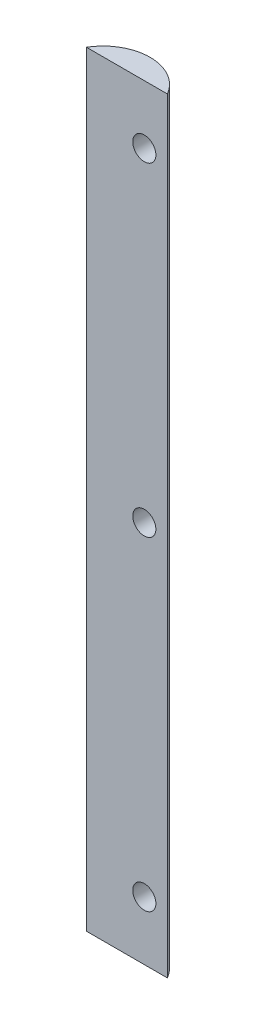
ISO-10303-21;
HEADER;
FILE_DESCRIPTION(('STEP AP214'),'2;1');
FILE_NAME('part.step','',(''),(''),'','','');
FILE_SCHEMA(('AUTOMOTIVE_DESIGN { 1 0 10303 214 1 1 1 1 }'));
ENDSEC;
DATA;
#1=APPLICATION_CONTEXT('core data for automotive mechanical design processes');
#2=APPLICATION_PROTOCOL_DEFINITION('international standard','automotive_design',2000,#1);
#3=PRODUCT_CONTEXT('',#1,'mechanical');
#4=PRODUCT('Part','Part','',(#3));
#5=PRODUCT_RELATED_PRODUCT_CATEGORY('part','',(#4));
#6=PRODUCT_DEFINITION_FORMATION('','',#4);
#7=PRODUCT_DEFINITION_CONTEXT('part definition',#1,'design');
#8=PRODUCT_DEFINITION('design','',#6,#7);
#9=PRODUCT_DEFINITION_SHAPE('','',#8);
#10=(LENGTH_UNIT() NAMED_UNIT(*) SI_UNIT(.MILLI.,.METRE.));
#11=(NAMED_UNIT(*) PLANE_ANGLE_UNIT() SI_UNIT($,.RADIAN.));
#12=(NAMED_UNIT(*) SI_UNIT($,.STERADIAN.) SOLID_ANGLE_UNIT());
#13=UNCERTAINTY_MEASURE_WITH_UNIT(LENGTH_MEASURE(1.E-05),#10,'distance_accuracy_value','');
#14=(GEOMETRIC_REPRESENTATION_CONTEXT(3) GLOBAL_UNCERTAINTY_ASSIGNED_CONTEXT((#13)) GLOBAL_UNIT_ASSIGNED_CONTEXT((#10,
#11,#12)) REPRESENTATION_CONTEXT('',''));
#15=CARTESIAN_POINT('',(0.,0.,0.));
#16=DIRECTION('',(0.,0.,1.));
#17=DIRECTION('',(1.,0.,0.));
#18=AXIS2_PLACEMENT_3D('',#15,#16,#17);
#19=CARTESIAN_POINT('',(0.,203.622402,0.));
#20=DIRECTION('',(0.,0.,-1.));
#21=DIRECTION('',(-1.,0.,0.));
#22=AXIS2_PLACEMENT_3D('',#19,#20,#21);
#23=PLANE('',#22);
#24=CARTESIAN_POINT('',(0.,9.736074,0.));
#25=DIRECTION('',(0.,0.,1.));
#26=DIRECTION('',(1.,0.,0.));
#27=AXIS2_PLACEMENT_3D('',#24,#25,#26);
#28=CIRCLE('',#27,3.175);
#29=CARTESIAN_POINT('',(3.175,9.736074,0.));
#30=VERTEX_POINT('',#29);
#31=EDGE_CURVE('E101',#30,#30,#28,.T.);
#32=ORIENTED_EDGE('',*,*,#31,.F.);
#33=EDGE_LOOP('',(#32));
#34=FACE_BOUND('',#33,.T.);
#35=CARTESIAN_POINT('',(0.,187.536328,0.));
#36=DIRECTION('',(0.,0.,1.));
#37=DIRECTION('',(1.,0.,0.));
#38=AXIS2_PLACEMENT_3D('',#35,#36,#37);
#39=CIRCLE('',#38,3.175);
#40=CARTESIAN_POINT('',(3.175,187.536328,0.));
#41=VERTEX_POINT('',#40);
#42=EDGE_CURVE('E132',#41,#41,#39,.T.);
#43=ORIENTED_EDGE('',*,*,#42,.F.);
#44=EDGE_LOOP('',(#43));
#45=FACE_BOUND('',#44,.T.);
#46=CARTESIAN_POINT('',(0.,98.636201,0.));
#47=DIRECTION('',(0.,0.,1.));
#48=DIRECTION('',(1.,0.,0.));
#49=AXIS2_PLACEMENT_3D('',#46,#47,#48);
#50=CIRCLE('',#49,3.175);
#51=CARTESIAN_POINT('',(3.175,98.636201,0.));
#52=VERTEX_POINT('',#51);
#53=EDGE_CURVE('E135',#52,#52,#50,.T.);
#54=ORIENTED_EDGE('',*,*,#53,.F.);
#55=EDGE_LOOP('',(#54));
#56=FACE_BOUND('',#55,.T.);
#57=DIRECTION('',(1.,0.,0.));
#58=VECTOR('',#57,1.);
#59=CARTESIAN_POINT('',(0.,-6.35,0.));
#60=LINE('',#59,#58);
#61=CARTESIAN_POINT('',(-15.875,-6.35,0.));
#62=VERTEX_POINT('',#61);
#63=CARTESIAN_POINT('',(6.35,-6.35,0.));
#64=VERTEX_POINT('',#63);
#65=EDGE_CURVE('E74',#62,#64,#60,.T.);
#66=ORIENTED_EDGE('',*,*,#65,.T.);
#67=DIRECTION('',(0.,-1.,0.));
#68=VECTOR('',#67,1.);
#69=CARTESIAN_POINT('',(6.35,203.622402,0.));
#70=LINE('',#69,#68);
#71=CARTESIAN_POINT('',(6.35,203.622402,0.));
#72=VERTEX_POINT('',#71);
#73=EDGE_CURVE('E11',#72,#64,#70,.T.);
#74=ORIENTED_EDGE('',*,*,#73,.F.);
#75=DIRECTION('',(1.,0.,0.));
#76=VECTOR('',#75,1.);
#77=CARTESIAN_POINT('',(0.,203.622402,0.));
#78=LINE('',#77,#76);
#79=CARTESIAN_POINT('',(-15.875,203.622402,0.));
#80=VERTEX_POINT('',#79);
#81=EDGE_CURVE('E86',#80,#72,#78,.T.);
#82=ORIENTED_EDGE('',*,*,#81,.F.);
#83=DIRECTION('',(0.,-1.,0.));
#84=VECTOR('',#83,1.);
#85=CARTESIAN_POINT('',(-15.875,203.622402,0.));
#86=LINE('',#85,#84);
#87=EDGE_CURVE('E57',#80,#62,#86,.T.);
#88=ORIENTED_EDGE('',*,*,#87,.T.);
#89=EDGE_LOOP('',(#66,#74,#82,#88));
#90=FACE_BOUND('',#89,.T.);
#91=ADVANCED_FACE('F43',(#34,#45,#56,#90),#23,.F.);
#92=CARTESIAN_POINT('',(-4.7625,203.622402,6.5484375));
#93=DIRECTION('',(0.,-1.,0.));
#94=DIRECTION('',(0.,0.,-1.));
#95=AXIS2_PLACEMENT_3D('',#92,#93,#94);
#96=CYLINDRICAL_SURFACE('',#95,12.8984375);
#97=CARTESIAN_POINT('',(3.175,9.736074,-3.61845896310054));
#98=CARTESIAN_POINT('',(3.17500029155845,9.8133440701708,-3.61845865162707));
#99=CARTESIAN_POINT('',(3.17217494628216,9.89061074148565,-3.62066641748478));
#100=CARTESIAN_POINT('',(3.16092477458739,10.0445145006741,-3.62943459894672));
#101=CARTESIAN_POINT('',(3.15249779231336,10.1211513346468,-3.63599669036239));
#102=CARTESIAN_POINT('',(3.13018830916982,10.2731438067568,-3.65329567583612));
#103=CARTESIAN_POINT('',(3.11630605119873,10.3484995017814,-3.6640323840174));
#104=CARTESIAN_POINT('',(3.08331514599964,10.4974013946925,-3.68939941002583));
#105=CARTESIAN_POINT('',(3.06420415714726,10.5709467657243,-3.7040314722612));
#106=CARTESIAN_POINT('',(2.99970218374855,10.7872154174017,-3.75305885545856));
#107=CARTESIAN_POINT('',(2.9469791643884,10.9266448482926,-3.79271518717727));
#108=CARTESIAN_POINT('',(2.82442881282292,11.1937761756134,-3.88295570262731));
#109=CARTESIAN_POINT('',(2.7545956444484,11.3214740500019,-3.93354361435851));
#110=CARTESIAN_POINT('',(2.59237992999635,11.5759558374709,-4.04808197326832));
#111=CARTESIAN_POINT('',(2.49844020076017,11.7013695954862,-4.11286301294358));
#112=CARTESIAN_POINT('',(2.29521823437965,11.9353118533229,-4.24847208060614));
#113=CARTESIAN_POINT('',(2.1859279353107,12.043831416977,-4.31930327835022));
#114=CARTESIAN_POINT('',(1.93138065942859,12.2626888557397,-4.47826997752821));
#115=CARTESIAN_POINT('',(1.78326915895043,12.3692354108075,-4.56708150040061));
#116=CARTESIAN_POINT('',(1.47119073823517,12.5555258022771,-4.74506321575416));
#117=CARTESIAN_POINT('',(1.30721296467085,12.6352511223092,-4.83423361318672));
#118=CARTESIAN_POINT('',(0.951295750286284,12.7716994809198,-5.01726678919523));
#119=CARTESIAN_POINT('',(0.75816587202052,12.8257675573429,-5.11084798187377));
#120=CARTESIAN_POINT('',(0.461109140868175,12.8790287940601,-5.24544016431096));
#121=CARTESIAN_POINT('',(0.360810762795936,12.8921419716694,-5.28936166307804));
#122=CARTESIAN_POINT('',(0.158465095092233,12.9087383343744,-5.37489298816599));
#123=CARTESIAN_POINT('',(0.0564187624306976,12.9122266293902,-5.41650402962234));
#124=CARTESIAN_POINT('',(-0.143697886170487,12.909323369538,-5.49512385220796));
#125=CARTESIAN_POINT('',(-0.24172620120115,12.9033942697464,-5.53225742551915));
#126=CARTESIAN_POINT('',(-0.437737274208506,12.8822970611551,-5.60380473376646));
#127=CARTESIAN_POINT('',(-0.535720030560132,12.8671335550416,-5.63821981402773));
#128=CARTESIAN_POINT('',(-0.730737999312872,12.8274403451485,-5.70412048241188));
#129=CARTESIAN_POINT('',(-0.827773509636956,12.8029136903861,-5.73560702003919));
#130=CARTESIAN_POINT('',(-1.0199433424238,12.7444661928637,-5.79551187375221));
#131=CARTESIAN_POINT('',(-1.11507785488985,12.7105462940378,-5.82393049773622));
#132=CARTESIAN_POINT('',(-1.2932752926261,12.6371810333219,-5.8750043601246));
#133=CARTESIAN_POINT('',(-1.3766104012884,12.5985976486948,-5.89795138845065));
#134=CARTESIAN_POINT('',(-1.54016736468118,12.5140208516425,-5.94129517591087));
#135=CARTESIAN_POINT('',(-1.62038811983224,12.4680248510579,-5.96169103985667));
#136=CARTESIAN_POINT('',(-1.77687845129753,12.3689232250418,-5.99995831517187));
#137=CARTESIAN_POINT('',(-1.85315059963565,12.3158223104882,-6.01783138326943));
#138=CARTESIAN_POINT('',(-2.00107961503945,12.2028501830638,-6.05116594048672));
#139=CARTESIAN_POINT('',(-2.07273482176762,12.142976555695,-6.06662656485746));
#140=CARTESIAN_POINT('',(-2.27159400513747,11.9612359662489,-6.10788997306092));
#141=CARTESIAN_POINT('',(-2.39212476680084,11.8312218078877,-6.13080529239027));
#142=CARTESIAN_POINT('',(-2.61018571307227,11.5523696410865,-6.169643174857));
#143=CARTESIAN_POINT('',(-2.70771789937332,11.4035332725808,-6.18556634666366));
#144=CARTESIAN_POINT('',(-2.87574692225581,11.0930857816891,-6.21153952657473));
#145=CARTESIAN_POINT('',(-2.94654490001103,10.9316433031202,-6.22165566629257));
#146=CARTESIAN_POINT('',(-3.0605142619,10.5990819302186,-6.23734638899209));
#147=CARTESIAN_POINT('',(-3.10368515705651,10.4279628646765,-6.24292089159091));
#148=CARTESIAN_POINT('',(-3.16124439987613,10.0801186249881,-6.25025492095319));
#149=CARTESIAN_POINT('',(-3.17550914635837,9.90337264518706,-6.25199806771476));
#150=CARTESIAN_POINT('',(-3.17446299904402,9.54996704055326,-6.25186828729976));
#151=CARTESIAN_POINT('',(-3.15915145950071,9.37330741769018,-6.24999528117078));
#152=CARTESIAN_POINT('',(-3.09932960260839,9.02463623712956,-6.24235818988753));
#153=CARTESIAN_POINT('',(-3.05474731888307,8.85263722633677,-6.2365845133512));
#154=CARTESIAN_POINT('',(-2.93765612238383,8.51865356832839,-6.22039579970276));
#155=CARTESIAN_POINT('',(-2.86514769772941,8.35666874613276,-6.20998084371483));
#156=CARTESIAN_POINT('',(-2.69464055060396,8.04770240415692,-6.18345321124056));
#157=CARTESIAN_POINT('',(-2.5966988674882,7.90068832360842,-6.16735325583885));
#158=CARTESIAN_POINT('',(-2.37838771763343,7.62544732575389,-6.12823219486352));
#159=CARTESIAN_POINT('',(-2.25802014982716,7.49721881940282,-6.10521167519394));
#160=CARTESIAN_POINT('',(-1.99941744380487,7.26358905683983,-6.05126056417378));
#161=CARTESIAN_POINT('',(-1.86126578240751,7.15808694835688,-6.02036630640185));
#162=CARTESIAN_POINT('',(-1.57125841800309,6.97175091325239,-5.94987856073665));
#163=CARTESIAN_POINT('',(-1.41940302371466,6.89091643109656,-5.910285268787));
#164=CARTESIAN_POINT('',(-1.10550994515041,6.75479896676959,-5.82180553620153));
#165=CARTESIAN_POINT('',(-0.94339388526986,6.69974900856806,-5.77283977329668));
#166=CARTESIAN_POINT('',(-0.615164246925479,6.61663774189246,-5.66627030457636));
#167=CARTESIAN_POINT('',(-0.44904988298656,6.58858178154044,-5.60866488966228));
#168=CARTESIAN_POINT('',(-0.109458564307643,6.55817050219822,-5.4829048252979));
#169=CARTESIAN_POINT('',(0.0639941384272888,6.55709649524786,-5.41437955571862));
#170=CARTESIAN_POINT('',(0.406009243876504,6.58246934219087,-5.27064333297133));
#171=CARTESIAN_POINT('',(0.574570106965335,6.60892476599904,-5.19543030457111));
#172=CARTESIAN_POINT('',(0.917794182473879,6.69106234489325,-5.03357505540364));
#173=CARTESIAN_POINT('',(1.09169140536315,6.74910914060321,-4.9465093365185));
#174=CARTESIAN_POINT('',(1.42611850843885,6.89353345112944,-4.76997774068824));
#175=CARTESIAN_POINT('',(1.58663659159165,6.97993564371016,-4.6805098356137));
#176=CARTESIAN_POINT('',(1.90346369918747,7.18731644785961,-4.49560605638029));
#177=CARTESIAN_POINT('',(2.05837804151772,7.31052926584323,-4.40027394193835));
#178=CARTESIAN_POINT('',(2.34470378385709,7.58610012216337,-4.21660928889522));
#179=CARTESIAN_POINT('',(2.4761352154676,7.73843308831215,-4.12827082068667));
#180=CARTESIAN_POINT('',(2.68414340342812,8.03289277473337,-3.98386963689914));
#181=CARTESIAN_POINT('',(2.76641145809164,8.16964162029325,-3.92501222527243));
#182=CARTESIAN_POINT('',(2.91081345377314,8.45792951738565,-3.81968463242392));
#183=CARTESIAN_POINT('',(2.97296687081608,8.60945407615836,-3.7732024766262));
#184=CARTESIAN_POINT('',(3.04804529007878,8.84354828249746,-3.71635786454596));
#185=CARTESIAN_POINT('',(3.06990380991777,8.92183194155513,-3.69966984511347));
#186=CARTESIAN_POINT('',(3.10767219938744,9.08060361580135,-3.67069401211238));
#187=CARTESIAN_POINT('',(3.12358517824933,9.16109045513002,-3.65840389879346));
#188=CARTESIAN_POINT('',(3.14916600743888,9.32358979287539,-3.63858824894905));
#189=CARTESIAN_POINT('',(3.15883683517379,9.40560154469904,-3.63106044091347));
#190=CARTESIAN_POINT('',(3.17175344510506,9.57043487144051,-3.62099614366395));
#191=CARTESIAN_POINT('',(3.17499968750935,9.65325638792587,-3.61845929693599));
#192=CARTESIAN_POINT('',(3.175,9.736074,-3.61845896310054));
#193=B_SPLINE_CURVE_WITH_KNOTS('',3,(#97,#98,#99,#100,#101,#102,#103,#104,#105,#106,#107,#108,
#109,#110,#111,#112,#113,#114,#115,#116,#117,#118,#119,#120,#121,#122,#123,#124,#125,#126,#127,
#128,#129,#130,#131,#132,#133,#134,#135,#136,#137,#138,#139,#140,#141,#142,#143,#144,#145,#146,
#147,#148,#149,#150,#151,#152,#153,#154,#155,#156,#157,#158,#159,#160,#161,#162,#163,#164,#165,
#166,#167,#168,#169,#170,#171,#172,#173,#174,#175,#176,#177,#178,#179,#180,#181,#182,#183,#184,
#185,#186,#187,#188,#189,#190,#191,#192),.UNSPECIFIED.,.T.,.F.,(4,2,2,2,2,2,2,2,2,2,2,2,2,2,2,2,
2,2,2,2,2,2,2,2,2,2,2,2,2,2,2,2,2,2,2,2,2,2,2,2,2,2,2,2,2,2,2,4),(0.,0.23172170254418,
0.463532637571483,0.695333252289377,0.927237846532124,1.38780878735856,1.84853704540815,
2.35536912389958,2.86246838644238,3.46869500436955,4.07533928356595,4.735587075844,
5.06604470425751,5.39632685652519,5.71088488491669,6.02528625696998,6.33958533452529,
6.65385283938742,6.9374587227516,7.22116384420985,7.5046817800491,7.78830111158175,
8.32177184268103,8.85519612572541,9.38241858057932,9.90965036659036,10.439131851098,
10.9686248960431,11.4994246762914,12.0302151791403,12.5598254035064,13.0893908029968,
13.6165554088367,14.1437081416398,14.6755371559432,15.2074715159301,15.7646208143044,
16.3219436052166,16.9282554412655,17.5350963574279,18.1911032211856,18.8465477923047,
19.3549401883814,19.8628388497613,20.1114634329343,20.3599578148524,20.6083335811239,
20.8566915550204),.UNSPECIFIED.);
#194=CARTESIAN_POINT('',(3.175,9.736074,-3.61845896310054));
#195=VERTEX_POINT('',#194);
#196=EDGE_CURVE('E46',#195,#195,#193,.T.);
#197=ORIENTED_EDGE('',*,*,#196,.T.);
#198=EDGE_LOOP('',(#197));
#199=FACE_BOUND('',#198,.T.);
#200=CARTESIAN_POINT('',(3.175,187.536328,-3.61845896310054));
#201=CARTESIAN_POINT('',(3.17500029155845,187.613598070171,-3.61845865162707));
#202=CARTESIAN_POINT('',(3.17217494628215,187.690864741486,-3.62066641748479));
#203=CARTESIAN_POINT('',(3.16092477458739,187.844768500674,-3.62943459894672));
#204=CARTESIAN_POINT('',(3.15249779231336,187.921405334647,-3.63599669036239));
#205=CARTESIAN_POINT('',(3.13018830916982,188.073397806757,-3.65329567583612));
#206=CARTESIAN_POINT('',(3.11630605119873,188.148753501781,-3.6640323840174));
#207=CARTESIAN_POINT('',(3.08331514599964,188.297655394692,-3.68939941002584));
#208=CARTESIAN_POINT('',(3.06420415714725,188.371200765724,-3.7040314722612));
#209=CARTESIAN_POINT('',(2.99970218374854,188.587469417402,-3.75305885545857));
#210=CARTESIAN_POINT('',(2.9469791643884,188.726898848293,-3.79271518717727));
#211=CARTESIAN_POINT('',(2.82442881282292,188.994030175613,-3.88295570262731));
#212=CARTESIAN_POINT('',(2.7545956444484,189.121728050002,-3.93354361435852));
#213=CARTESIAN_POINT('',(2.59237992999635,189.376209837471,-4.04808197326832));
#214=CARTESIAN_POINT('',(2.49844020076016,189.501623595486,-4.11286301294359));
#215=CARTESIAN_POINT('',(2.29521823437963,189.735565853323,-4.24847208060615));
#216=CARTESIAN_POINT('',(2.18592793531068,189.844085416977,-4.31930327835023));
#217=CARTESIAN_POINT('',(1.93138065942857,190.06294285574,-4.47826997752823));
#218=CARTESIAN_POINT('',(1.78326915895041,190.169489410808,-4.56708150040062));
#219=CARTESIAN_POINT('',(1.47119073823514,190.355779802277,-4.74506321575417));
#220=CARTESIAN_POINT('',(1.30721296467082,190.435505122309,-4.83423361318674));
#221=CARTESIAN_POINT('',(0.951295750286251,190.57195348092,-5.01726678919525));
#222=CARTESIAN_POINT('',(0.758165872020489,190.626021557343,-5.11084798187379));
#223=CARTESIAN_POINT('',(0.461109140868147,190.67928279406,-5.24544016431098));
#224=CARTESIAN_POINT('',(0.360810762795909,190.692395971669,-5.28936166307805));
#225=CARTESIAN_POINT('',(0.158465095092208,190.708992334374,-5.374892988166));
#226=CARTESIAN_POINT('',(0.056418762430673,190.71248062939,-5.41650402962235));
#227=CARTESIAN_POINT('',(-0.14369788617051,190.709577369538,-5.49512385220797));
#228=CARTESIAN_POINT('',(-0.241726201201172,190.703648269746,-5.53225742551916));
#229=CARTESIAN_POINT('',(-0.437737274208527,190.682551061155,-5.60380473376647));
#230=CARTESIAN_POINT('',(-0.535720030560153,190.667387555042,-5.63821981402774));
#231=CARTESIAN_POINT('',(-0.730737999312891,190.627694345149,-5.70412048241189));
#232=CARTESIAN_POINT('',(-0.827773509636972,190.603167690386,-5.7356070200392));
#233=CARTESIAN_POINT('',(-1.01994334242381,190.544720192864,-5.79551187375221));
#234=CARTESIAN_POINT('',(-1.11507785488987,190.510800294038,-5.82393049773623));
#235=CARTESIAN_POINT('',(-1.29327529262612,190.437435033322,-5.8750043601246));
#236=CARTESIAN_POINT('',(-1.37661040128841,190.398851648695,-5.89795138845065));
#237=CARTESIAN_POINT('',(-1.54016736468118,190.314274851643,-5.94129517591087));
#238=CARTESIAN_POINT('',(-1.62038811983223,190.268278851058,-5.96169103985667));
#239=CARTESIAN_POINT('',(-1.77687845129753,190.169177225042,-5.99995831517187));
#240=CARTESIAN_POINT('',(-1.85315059963565,190.116076310488,-6.01783138326944));
#241=CARTESIAN_POINT('',(-2.00107961503946,190.003104183064,-6.05116594048672));
#242=CARTESIAN_POINT('',(-2.07273482176763,189.943230555695,-6.06662656485746));
#243=CARTESIAN_POINT('',(-2.27159400513748,189.761489966249,-6.10788997306091));
#244=CARTESIAN_POINT('',(-2.39212476680085,189.631475807888,-6.13080529239027));
#245=CARTESIAN_POINT('',(-2.61018571307228,189.352623641086,-6.169643174857));
#246=CARTESIAN_POINT('',(-2.70771789937333,189.203787272581,-6.18556634666366));
#247=CARTESIAN_POINT('',(-2.87574692225582,188.893339781689,-6.21153952657473));
#248=CARTESIAN_POINT('',(-2.94654490001103,188.73189730312,-6.22165566629257));
#249=CARTESIAN_POINT('',(-3.0605142619,188.399335930219,-6.23734638899209));
#250=CARTESIAN_POINT('',(-3.10368515705651,188.228216864676,-6.24292089159091));
#251=CARTESIAN_POINT('',(-3.16124439987613,187.880372624988,-6.25025492095319));
#252=CARTESIAN_POINT('',(-3.17550914635836,187.703626645187,-6.25199806771476));
#253=CARTESIAN_POINT('',(-3.17446299904402,187.350221040553,-6.25186828729976));
#254=CARTESIAN_POINT('',(-3.1591514595007,187.17356141769,-6.24999528117078));
#255=CARTESIAN_POINT('',(-3.09932960260838,186.82489023713,-6.24235818988753));
#256=CARTESIAN_POINT('',(-3.05474731888307,186.652891226337,-6.2365845133512));
#257=CARTESIAN_POINT('',(-2.93765612238383,186.318907568328,-6.22039579970276));
#258=CARTESIAN_POINT('',(-2.86514769772941,186.156922746133,-6.20998084371483));
#259=CARTESIAN_POINT('',(-2.69464055060396,185.847956404157,-6.18345321124056));
#260=CARTESIAN_POINT('',(-2.5966988674882,185.700942323608,-6.16735325583885));
#261=CARTESIAN_POINT('',(-2.37838771763343,185.425701325754,-6.12823219486352));
#262=CARTESIAN_POINT('',(-2.25802014982716,185.297472819403,-6.10521167519394));
#263=CARTESIAN_POINT('',(-1.99941744380487,185.06384305684,-6.05126056417378));
#264=CARTESIAN_POINT('',(-1.86126578240751,184.958340948357,-6.02036630640185));
#265=CARTESIAN_POINT('',(-1.57125841800308,184.772004913252,-5.94987856073664));
#266=CARTESIAN_POINT('',(-1.41940302371464,184.691170431097,-5.910285268787));
#267=CARTESIAN_POINT('',(-1.10550994515039,184.55505296677,-5.82180553620153));
#268=CARTESIAN_POINT('',(-0.943393885269845,184.500003008568,-5.77283977329667));
#269=CARTESIAN_POINT('',(-0.615164246925464,184.416891741892,-5.66627030457635));
#270=CARTESIAN_POINT('',(-0.449049882986542,184.38883578154,-5.60866488966228));
#271=CARTESIAN_POINT('',(-0.109458564307624,184.358424502198,-5.48290482529789));
#272=CARTESIAN_POINT('',(0.0639941384273068,184.357350495248,-5.41437955571861));
#273=CARTESIAN_POINT('',(0.406009243876522,184.382723342191,-5.27064333297132));
#274=CARTESIAN_POINT('',(0.574570106965352,184.409178765999,-5.1954303045711));
#275=CARTESIAN_POINT('',(0.917794182473897,184.491316344893,-5.03357505540363));
#276=CARTESIAN_POINT('',(1.09169140536317,184.549363140603,-4.94650933651849));
#277=CARTESIAN_POINT('',(1.42611850843887,184.693787451129,-4.76997774068823));
#278=CARTESIAN_POINT('',(1.58663659159167,184.78018964371,-4.6805098356137));
#279=CARTESIAN_POINT('',(1.90346369918749,184.98757044786,-4.49560605638028));
#280=CARTESIAN_POINT('',(2.05837804151774,185.110783265843,-4.40027394193833));
#281=CARTESIAN_POINT('',(2.3447037838571,185.386354122163,-4.21660928889521));
#282=CARTESIAN_POINT('',(2.47613521546761,185.538687088312,-4.12827082068666));
#283=CARTESIAN_POINT('',(2.68414340342813,185.833146774733,-3.98386963689913));
#284=CARTESIAN_POINT('',(2.76641145809165,185.969895620293,-3.92501222527242));
#285=CARTESIAN_POINT('',(2.91081345377315,186.258183517386,-3.81968463242391));
#286=CARTESIAN_POINT('',(2.9729668708161,186.409708076158,-3.77320247662619));
#287=CARTESIAN_POINT('',(3.04804529007879,186.643802282497,-3.71635786454595));
#288=CARTESIAN_POINT('',(3.06990380991777,186.722085941555,-3.69966984511347));
#289=CARTESIAN_POINT('',(3.10767219938745,186.880857615801,-3.67069401211237));
#290=CARTESIAN_POINT('',(3.12358517824933,186.96134445513,-3.65840389879346));
#291=CARTESIAN_POINT('',(3.14916600743888,187.123843792875,-3.63858824894905));
#292=CARTESIAN_POINT('',(3.15883683517379,187.205855544699,-3.63106044091347));
#293=CARTESIAN_POINT('',(3.17175344510506,187.37068887144,-3.62099614366396));
#294=CARTESIAN_POINT('',(3.17499968750934,187.453510387926,-3.61845929693599));
#295=CARTESIAN_POINT('',(3.175,187.536328,-3.61845896310054));
#296=B_SPLINE_CURVE_WITH_KNOTS('',3,(#200,#201,#202,#203,#204,#205,#206,#207,#208,#209,#210,
#211,#212,#213,#214,#215,#216,#217,#218,#219,#220,#221,#222,#223,#224,#225,#226,#227,#228,#229,
#230,#231,#232,#233,#234,#235,#236,#237,#238,#239,#240,#241,#242,#243,#244,#245,#246,#247,#248,
#249,#250,#251,#252,#253,#254,#255,#256,#257,#258,#259,#260,#261,#262,#263,#264,#265,#266,#267,
#268,#269,#270,#271,#272,#273,#274,#275,#276,#277,#278,#279,#280,#281,#282,#283,#284,#285,#286,
#287,#288,#289,#290,#291,#292,#293,#294,#295),.UNSPECIFIED.,.T.,.F.,(4,2,2,2,2,2,2,2,2,2,2,2,2,
2,2,2,2,2,2,2,2,2,2,2,2,2,2,2,2,2,2,2,2,2,2,2,2,2,2,2,2,2,2,2,2,2,2,4),(0.,0.231721702544166,
0.463532637571486,0.695333252289376,0.927237846532139,1.38780878735857,1.84853704540817,
2.3553691238996,2.8624683864424,3.46869500436958,4.07533928356599,4.73558707584404,
5.06604470425754,5.39632685652522,5.71088488491672,6.02528625697,6.33958533452531,
6.65385283938745,6.9374587227516,7.22116384420986,7.50468178004912,7.78830111158178,
8.32177184268104,8.85519612572543,9.38241858057933,9.9096503665904,10.439131851098,
10.9686248960431,11.4994246762915,12.0302151791403,12.5598254035064,13.0893908029969,
13.6165554088367,14.1437081416398,14.6755371559432,15.2074715159301,15.7646208143044,
16.3219436052166,16.9282554412655,17.5350963574279,18.1911032211856,18.8465477923047,
19.3549401883814,19.8628388497613,20.1114634329343,20.3599578148524,20.6083335811239,
20.8566915550204),.UNSPECIFIED.);
#297=CARTESIAN_POINT('',(3.175,187.536328,-3.61845896310054));
#298=VERTEX_POINT('',#297);
#299=EDGE_CURVE('E100',#298,#298,#296,.T.);
#300=ORIENTED_EDGE('',*,*,#299,.T.);
#301=EDGE_LOOP('',(#300));
#302=FACE_BOUND('',#301,.T.);
#303=CARTESIAN_POINT('',(3.175,98.636201,-3.61845896310054));
#304=CARTESIAN_POINT('',(3.17500029155845,98.7134710701708,-3.61845865162707));
#305=CARTESIAN_POINT('',(3.17217494628215,98.7907377414856,-3.62066641748478));
#306=CARTESIAN_POINT('',(3.16092477458739,98.9446415006741,-3.62943459894672));
#307=CARTESIAN_POINT('',(3.15249779231336,99.0212783346468,-3.6359966903624));
#308=CARTESIAN_POINT('',(3.13018830916982,99.1732708067568,-3.65329567583612));
#309=CARTESIAN_POINT('',(3.11630605119873,99.2486265017814,-3.6640323840174));
#310=CARTESIAN_POINT('',(3.08331514599964,99.3975283946925,-3.68939941002583));
#311=CARTESIAN_POINT('',(3.06420415714726,99.4710737657243,-3.7040314722612));
#312=CARTESIAN_POINT('',(2.99970218374854,99.6873424174017,-3.75305885545857));
#313=CARTESIAN_POINT('',(2.9469791643884,99.8267718482926,-3.79271518717727));
#314=CARTESIAN_POINT('',(2.82442881282292,100.093903175613,-3.88295570262731));
#315=CARTESIAN_POINT('',(2.7545956444484,100.221601050002,-3.93354361435852));
#316=CARTESIAN_POINT('',(2.59237992999636,100.476082837471,-4.04808197326832));
#317=CARTESIAN_POINT('',(2.49844020076017,100.601496595486,-4.11286301294358));
#318=CARTESIAN_POINT('',(2.29521823437965,100.835438853323,-4.24847208060614));
#319=CARTESIAN_POINT('',(2.1859279353107,100.943958416977,-4.31930327835022));
#320=CARTESIAN_POINT('',(1.9313806594286,101.16281585574,-4.47826997752821));
#321=CARTESIAN_POINT('',(1.78326915895044,101.269362410808,-4.56708150040061));
#322=CARTESIAN_POINT('',(1.47119073823517,101.455652802277,-4.74506321575416));
#323=CARTESIAN_POINT('',(1.30721296467086,101.535378122309,-4.83423361318672));
#324=CARTESIAN_POINT('',(0.951295750286294,101.67182648092,-5.01726678919523));
#325=CARTESIAN_POINT('',(0.758165872020527,101.725894557343,-5.11084798187377));
#326=CARTESIAN_POINT('',(0.46110914086818,101.77915579406,-5.24544016431096));
#327=CARTESIAN_POINT('',(0.36081076279594,101.792268971669,-5.28936166307804));
#328=CARTESIAN_POINT('',(0.158465095092237,101.808865334374,-5.37489298816599));
#329=CARTESIAN_POINT('',(0.0564187624307016,101.81235362939,-5.41650402962234));
#330=CARTESIAN_POINT('',(-0.143697886170484,101.809450369538,-5.49512385220796));
#331=CARTESIAN_POINT('',(-0.241726201201147,101.803521269746,-5.53225742551915));
#332=CARTESIAN_POINT('',(-0.437737274208503,101.782424061155,-5.60380473376646));
#333=CARTESIAN_POINT('',(-0.535720030560128,101.767260555042,-5.63821981402773));
#334=CARTESIAN_POINT('',(-0.730737999312869,101.727567345149,-5.70412048241188));
#335=CARTESIAN_POINT('',(-0.827773509636953,101.703040690386,-5.73560702003919));
#336=CARTESIAN_POINT('',(-1.01994334242379,101.644593192864,-5.79551187375221));
#337=CARTESIAN_POINT('',(-1.11507785488985,101.610673294038,-5.82393049773622));
#338=CARTESIAN_POINT('',(-1.2932752926261,101.537308033322,-5.8750043601246));
#339=CARTESIAN_POINT('',(-1.37661040128839,101.498724648695,-5.89795138845065));
#340=CARTESIAN_POINT('',(-1.54016736468117,101.414147851643,-5.94129517591087));
#341=CARTESIAN_POINT('',(-1.62038811983223,101.368151851058,-5.96169103985667));
#342=CARTESIAN_POINT('',(-1.77687845129753,101.269050225042,-5.99995831517187));
#343=CARTESIAN_POINT('',(-1.85315059963564,101.215949310488,-6.01783138326943));
#344=CARTESIAN_POINT('',(-2.00107961503944,101.102977183064,-6.05116594048672));
#345=CARTESIAN_POINT('',(-2.07273482176761,101.043103555695,-6.06662656485746));
#346=CARTESIAN_POINT('',(-2.27159400513747,100.861362966249,-6.10788997306091));
#347=CARTESIAN_POINT('',(-2.39212476680084,100.731348807888,-6.13080529239027));
#348=CARTESIAN_POINT('',(-2.61018571307227,100.452496641086,-6.169643174857));
#349=CARTESIAN_POINT('',(-2.70771789937332,100.303660272581,-6.18556634666365));
#350=CARTESIAN_POINT('',(-2.87574692225581,99.9932127816891,-6.21153952657473));
#351=CARTESIAN_POINT('',(-2.94654490001103,99.8317703031202,-6.22165566629257));
#352=CARTESIAN_POINT('',(-3.0605142619,99.4992089302186,-6.23734638899209));
#353=CARTESIAN_POINT('',(-3.10368515705651,99.3280898646765,-6.24292089159091));
#354=CARTESIAN_POINT('',(-3.16124439987612,98.9802456249881,-6.25025492095319));
#355=CARTESIAN_POINT('',(-3.17550914635836,98.8034996451871,-6.25199806771476));
#356=CARTESIAN_POINT('',(-3.17446299904402,98.4500940405533,-6.25186828729976));
#357=CARTESIAN_POINT('',(-3.15915145950071,98.2734344176902,-6.24999528117078));
#358=CARTESIAN_POINT('',(-3.09932960260838,97.9247632371296,-6.24235818988753));
#359=CARTESIAN_POINT('',(-3.05474731888307,97.7527642263368,-6.2365845133512));
#360=CARTESIAN_POINT('',(-2.93765612238383,97.4187805683284,-6.22039579970276));
#361=CARTESIAN_POINT('',(-2.86514769772941,97.2567957461328,-6.20998084371483));
#362=CARTESIAN_POINT('',(-2.69464055060396,96.9478294041569,-6.18345321124056));
#363=CARTESIAN_POINT('',(-2.5966988674882,96.8008153236084,-6.16735325583885));
#364=CARTESIAN_POINT('',(-2.37838771763343,96.5255743257539,-6.12823219486351));
#365=CARTESIAN_POINT('',(-2.25802014982716,96.3973458194028,-6.10521167519394));
#366=CARTESIAN_POINT('',(-1.99941744380487,96.1637160568398,-6.05126056417379));
#367=CARTESIAN_POINT('',(-1.86126578240752,96.0582139483569,-6.02036630640185));
#368=CARTESIAN_POINT('',(-1.5712584180031,95.8718779132524,-5.94987856073665));
#369=CARTESIAN_POINT('',(-1.41940302371466,95.7910434310966,-5.910285268787));
#370=CARTESIAN_POINT('',(-1.10550994515041,95.6549259667696,-5.82180553620153));
#371=CARTESIAN_POINT('',(-0.943393885269863,95.599876008568,-5.77283977329668));
#372=CARTESIAN_POINT('',(-0.615164246925485,95.5167647418924,-5.66627030457636));
#373=CARTESIAN_POINT('',(-0.449049882986565,95.4887087815404,-5.60866488966228));
#374=CARTESIAN_POINT('',(-0.109458564307647,95.4582975021982,-5.4829048252979));
#375=CARTESIAN_POINT('',(0.0639941384272838,95.4572234952478,-5.41437955571862));
#376=CARTESIAN_POINT('',(0.406009243876499,95.4825963421909,-5.27064333297133));
#377=CARTESIAN_POINT('',(0.57457010696533,95.509051765999,-5.19543030457111));
#378=CARTESIAN_POINT('',(0.917794182473874,95.5911893448932,-5.03357505540364));
#379=CARTESIAN_POINT('',(1.09169140536314,95.6492361406032,-4.9465093365185));
#380=CARTESIAN_POINT('',(1.42611850843885,95.7936604511294,-4.76997774068824));
#381=CARTESIAN_POINT('',(1.58663659159164,95.8800626437102,-4.68050983561371));
#382=CARTESIAN_POINT('',(1.90346369918747,96.0874434478596,-4.4956060563803));
#383=CARTESIAN_POINT('',(2.05837804151772,96.2106562658432,-4.40027394193835));
#384=CARTESIAN_POINT('',(2.34470378385709,96.4862271221634,-4.21660928889522));
#385=CARTESIAN_POINT('',(2.4761352154676,96.6385600883121,-4.12827082068667));
#386=CARTESIAN_POINT('',(2.68414340342811,96.9330197747334,-3.98386963689914));
#387=CARTESIAN_POINT('',(2.76641145809164,97.0697686202932,-3.92501222527243));
#388=CARTESIAN_POINT('',(2.91081345377314,97.3580565173856,-3.81968463242392));
#389=CARTESIAN_POINT('',(2.97296687081608,97.5095810761584,-3.7732024766262));
#390=CARTESIAN_POINT('',(3.04804529007878,97.7436752824975,-3.71635786454596));
#391=CARTESIAN_POINT('',(3.06990380991777,97.8219589415551,-3.69966984511347));
#392=CARTESIAN_POINT('',(3.10767219938744,97.9807306158013,-3.67069401211238));
#393=CARTESIAN_POINT('',(3.12358517824933,98.06121745513,-3.65840389879346));
#394=CARTESIAN_POINT('',(3.14916600743888,98.2237167928754,-3.63858824894905));
#395=CARTESIAN_POINT('',(3.15883683517379,98.305728544699,-3.63106044091347));
#396=CARTESIAN_POINT('',(3.17175344510506,98.4705618714405,-3.62099614366396));
#397=CARTESIAN_POINT('',(3.17499968750934,98.5533833879259,-3.61845929693599));
#398=CARTESIAN_POINT('',(3.175,98.636201,-3.61845896310054));
#399=B_SPLINE_CURVE_WITH_KNOTS('',3,(#303,#304,#305,#306,#307,#308,#309,#310,#311,#312,#313,
#314,#315,#316,#317,#318,#319,#320,#321,#322,#323,#324,#325,#326,#327,#328,#329,#330,#331,#332,
#333,#334,#335,#336,#337,#338,#339,#340,#341,#342,#343,#344,#345,#346,#347,#348,#349,#350,#351,
#352,#353,#354,#355,#356,#357,#358,#359,#360,#361,#362,#363,#364,#365,#366,#367,#368,#369,#370,
#371,#372,#373,#374,#375,#376,#377,#378,#379,#380,#381,#382,#383,#384,#385,#386,#387,#388,#389,
#390,#391,#392,#393,#394,#395,#396,#397,#398),.UNSPECIFIED.,.T.,.F.,(4,2,2,2,2,2,2,2,2,2,2,2,2,
2,2,2,2,2,2,2,2,2,2,2,2,2,2,2,2,2,2,2,2,2,2,2,2,2,2,2,2,2,2,2,2,2,2,4),(0.,0.23172170254418,
0.463532637571472,0.695333252289375,0.927237846532124,1.38780878735857,1.84853704540814,
2.35536912389956,2.86246838644238,3.46869500436954,4.07533928356594,4.735587075844,
5.06604470425751,5.39632685652518,5.71088488491669,6.02528625696998,6.33958533452528,
6.65385283938742,6.93745872275159,7.22116384420984,7.5046817800491,7.78830111158174,
8.32177184268102,8.85519612572542,9.38241858057933,9.90965036659034,10.439131851098,
10.9686248960431,11.4994246762914,12.0302151791403,12.5598254035064,13.0893908029968,
13.6165554088367,14.1437081416398,14.6755371559432,15.2074715159301,15.7646208143044,
16.3219436052166,16.9282554412655,17.5350963574279,18.1911032211856,18.8465477923047,
19.3549401883814,19.8628388497613,20.1114634329343,20.3599578148524,20.6083335811239,
20.8566915550204),.UNSPECIFIED.);
#400=CARTESIAN_POINT('',(3.175,98.636201,-3.61845896310054));
#401=VERTEX_POINT('',#400);
#402=EDGE_CURVE('E93',#401,#401,#399,.T.);
#403=ORIENTED_EDGE('',*,*,#402,.T.);
#404=EDGE_LOOP('',(#403));
#405=FACE_BOUND('',#404,.T.);
#406=CARTESIAN_POINT('',(-4.7625,-6.35,6.5484375));
#407=DIRECTION('',(0.,1.,0.));
#408=DIRECTION('',(0.,0.,-1.));
#409=AXIS2_PLACEMENT_3D('',#406,#407,#408);
#410=CIRCLE('',#409,12.8984375);
#411=EDGE_CURVE('E79',#64,#62,#410,.T.);
#412=ORIENTED_EDGE('',*,*,#411,.T.);
#413=ORIENTED_EDGE('',*,*,#87,.F.);
#414=CARTESIAN_POINT('',(-4.7625,203.622402,6.5484375));
#415=DIRECTION('',(0.,1.,0.));
#416=DIRECTION('',(0.,0.,-1.));
#417=AXIS2_PLACEMENT_3D('',#414,#415,#416);
#418=CIRCLE('',#417,12.8984375);
#419=EDGE_CURVE('E65',#72,#80,#418,.T.);
#420=ORIENTED_EDGE('',*,*,#419,.F.);
#421=ORIENTED_EDGE('',*,*,#73,.T.);
#422=EDGE_LOOP('',(#412,#413,#420,#421));
#423=FACE_BOUND('',#422,.T.);
#424=ADVANCED_FACE('F83',(#199,#302,#405,#423),#96,.T.);
#425=CARTESIAN_POINT('',(-4.7625,203.622402,6.5484375));
#426=DIRECTION('',(0.,-1.,0.));
#427=DIRECTION('',(0.,0.,-1.));
#428=AXIS2_PLACEMENT_3D('',#425,#426,#427);
#429=PLANE('',#428);
#430=ORIENTED_EDGE('',*,*,#81,.T.);
#431=ORIENTED_EDGE('',*,*,#419,.T.);
#432=EDGE_LOOP('',(#430,#431));
#433=FACE_BOUND('',#432,.T.);
#434=ADVANCED_FACE('F115',(#433),#429,.F.);
#435=CARTESIAN_POINT('',(-4.7625,-6.35,6.5484375));
#436=DIRECTION('',(0.,-1.,0.));
#437=DIRECTION('',(0.,0.,-1.));
#438=AXIS2_PLACEMENT_3D('',#435,#436,#437);
#439=PLANE('',#438);
#440=ORIENTED_EDGE('',*,*,#65,.F.);
#441=ORIENTED_EDGE('',*,*,#411,.F.);
#442=EDGE_LOOP('',(#440,#441));
#443=FACE_BOUND('',#442,.T.);
#444=ADVANCED_FACE('F78',(#443),#439,.T.);
#445=CARTESIAN_POINT('',(0.,98.636201,-6.35));
#446=DIRECTION('',(0.,0.,1.));
#447=DIRECTION('',(1.,0.,0.));
#448=AXIS2_PLACEMENT_3D('',#445,#446,#447);
#449=CYLINDRICAL_SURFACE('',#448,3.175);
#450=ORIENTED_EDGE('',*,*,#53,.T.);
#451=EDGE_LOOP('',(#450));
#452=FACE_BOUND('',#451,.T.);
#453=ORIENTED_EDGE('',*,*,#402,.F.);
#454=EDGE_LOOP('',(#453));
#455=FACE_BOUND('',#454,.T.);
#456=ADVANCED_FACE('F108',(#452,#455),#449,.F.);
#457=CARTESIAN_POINT('',(0.,187.536328,-6.35));
#458=DIRECTION('',(0.,0.,1.));
#459=DIRECTION('',(1.,0.,0.));
#460=AXIS2_PLACEMENT_3D('',#457,#458,#459);
#461=CYLINDRICAL_SURFACE('',#460,3.175);
#462=ORIENTED_EDGE('',*,*,#42,.T.);
#463=EDGE_LOOP('',(#462));
#464=FACE_BOUND('',#463,.T.);
#465=ORIENTED_EDGE('',*,*,#299,.F.);
#466=EDGE_LOOP('',(#465));
#467=FACE_BOUND('',#466,.T.);
#468=ADVANCED_FACE('F112',(#464,#467),#461,.F.);
#469=CARTESIAN_POINT('',(0.,9.736074,-6.35));
#470=DIRECTION('',(0.,0.,1.));
#471=DIRECTION('',(1.,0.,0.));
#472=AXIS2_PLACEMENT_3D('',#469,#470,#471);
#473=CYLINDRICAL_SURFACE('',#472,3.175);
#474=ORIENTED_EDGE('',*,*,#31,.T.);
#475=EDGE_LOOP('',(#474));
#476=FACE_BOUND('',#475,.T.);
#477=ORIENTED_EDGE('',*,*,#196,.F.);
#478=EDGE_LOOP('',(#477));
#479=FACE_BOUND('',#478,.T.);
#480=ADVANCED_FACE('F149',(#476,#479),#473,.F.);
#481=CLOSED_SHELL('',(#91,#424,#434,#444,#456,#468,#480));
#482=MANIFOLD_SOLID_BREP('B2',#481);
#483=ADVANCED_BREP_SHAPE_REPRESENTATION('',(#18,#482),#14);
#484=SHAPE_DEFINITION_REPRESENTATION(#9,#483);
ENDSEC;
END-ISO-10303-21;
